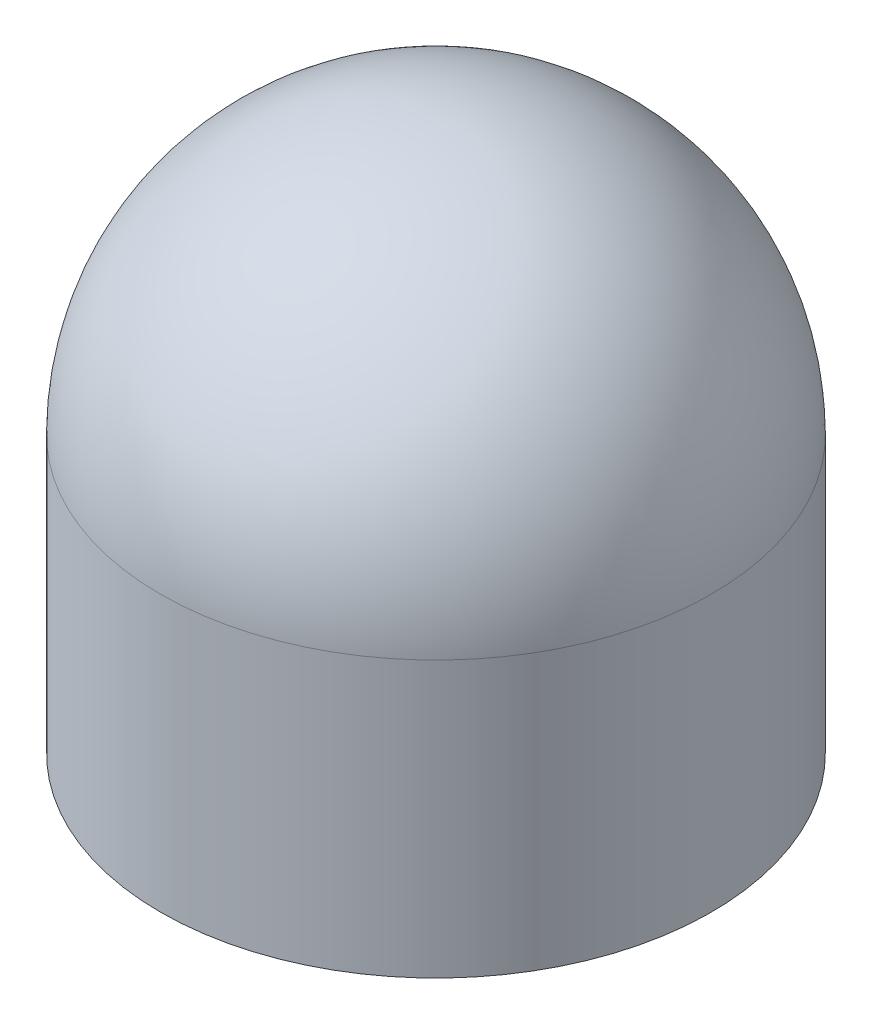
ISO-10303-21;
HEADER;
FILE_DESCRIPTION(('STEP AP214'),'2;1');
FILE_NAME('part.step','',(''),(''),'','','');
FILE_SCHEMA(('AUTOMOTIVE_DESIGN { 1 0 10303 214 1 1 1 1 }'));
ENDSEC;
DATA;
#1=APPLICATION_CONTEXT('core data for automotive mechanical design processes');
#2=APPLICATION_PROTOCOL_DEFINITION('international standard','automotive_design',2000,#1);
#3=PRODUCT_CONTEXT('',#1,'mechanical');
#4=PRODUCT('Part','Part','',(#3));
#5=PRODUCT_RELATED_PRODUCT_CATEGORY('part','',(#4));
#6=PRODUCT_DEFINITION_FORMATION('','',#4);
#7=PRODUCT_DEFINITION_CONTEXT('part definition',#1,'design');
#8=PRODUCT_DEFINITION('design','',#6,#7);
#9=PRODUCT_DEFINITION_SHAPE('','',#8);
#10=(LENGTH_UNIT() NAMED_UNIT(*) SI_UNIT(.MILLI.,.METRE.));
#11=(NAMED_UNIT(*) PLANE_ANGLE_UNIT() SI_UNIT($,.RADIAN.));
#12=(NAMED_UNIT(*) SI_UNIT($,.STERADIAN.) SOLID_ANGLE_UNIT());
#13=UNCERTAINTY_MEASURE_WITH_UNIT(LENGTH_MEASURE(1.E-05),#10,'distance_accuracy_value','');
#14=(GEOMETRIC_REPRESENTATION_CONTEXT(3) GLOBAL_UNCERTAINTY_ASSIGNED_CONTEXT((#13)) GLOBAL_UNIT_ASSIGNED_CONTEXT((#10,
#11,#12)) REPRESENTATION_CONTEXT('',''));
#15=CARTESIAN_POINT('',(0.,0.,0.));
#16=DIRECTION('',(0.,0.,1.));
#17=DIRECTION('',(1.,0.,0.));
#18=AXIS2_PLACEMENT_3D('',#15,#16,#17);
#19=CARTESIAN_POINT('',(-37.1905059288554,3.,-7.69867160947643));
#20=DIRECTION('',(0.,-1.,0.));
#21=DIRECTION('',(0.,0.,-1.));
#22=AXIS2_PLACEMENT_3D('',#19,#20,#21);
#23=CYLINDRICAL_SURFACE('',#22,3.);
#24=CARTESIAN_POINT('',(-37.1905059288554,3.,-7.69867160947643));
#25=DIRECTION('',(0.,1.,0.));
#26=DIRECTION('',(0.,0.,1.));
#27=AXIS2_PLACEMENT_3D('',#24,#25,#26);
#28=CIRCLE('',#27,3.);
#29=CARTESIAN_POINT('',(-37.1905059288554,3.,-4.69867160947643));
#30=VERTEX_POINT('',#29);
#31=EDGE_CURVE('E11',#30,#30,#28,.T.);
#32=ORIENTED_EDGE('',*,*,#31,.F.);
#33=EDGE_LOOP('',(#32));
#34=FACE_BOUND('',#33,.T.);
#35=CARTESIAN_POINT('',(-37.1905059288554,0.,-7.69867160947643));
#36=DIRECTION('',(0.,1.,0.));
#37=DIRECTION('',(0.,0.,1.));
#38=AXIS2_PLACEMENT_3D('',#35,#36,#37);
#39=CIRCLE('',#38,3.);
#40=CARTESIAN_POINT('',(-37.1905059288554,0.,-4.69867160947643));
#41=VERTEX_POINT('',#40);
#42=EDGE_CURVE('E38',#41,#41,#39,.T.);
#43=ORIENTED_EDGE('',*,*,#42,.T.);
#44=EDGE_LOOP('',(#43));
#45=FACE_BOUND('',#44,.T.);
#46=ADVANCED_FACE('F35',(#34,#45),#23,.T.);
#47=CARTESIAN_POINT('',(-37.1905059288554,0.,-7.69867160947643));
#48=DIRECTION('',(0.,1.,0.));
#49=DIRECTION('',(0.,0.,1.));
#50=AXIS2_PLACEMENT_3D('',#47,#48,#49);
#51=PLANE('',#50);
#52=CARTESIAN_POINT('',(-37.1905059288554,0.,-7.69867160947643));
#53=VERTEX_POINT('',#52);
#54=VERTEX_LOOP('',#53);
#55=FACE_BOUND('',#54,.T.);
#56=ORIENTED_EDGE('',*,*,#42,.F.);
#57=EDGE_LOOP('',(#56));
#58=FACE_BOUND('',#57,.T.);
#59=ADVANCED_FACE('F44',(#55,#58),#51,.F.);
#60=CARTESIAN_POINT('',(-37.1905059288554,3.,-7.69867160947643));
#61=DIRECTION('',(0.,0.,-1.));
#62=DIRECTION('',(1.,0.,0.));
#63=AXIS2_PLACEMENT_3D('',#60,#61,#62);
#64=SPHERICAL_SURFACE('',#63,3.);
#65=CARTESIAN_POINT('',(-37.1905059288554,3.,-7.69867160947643));
#66=DIRECTION('',(0.,1.,0.));
#67=DIRECTION('',(0.,0.,1.));
#68=AXIS2_PLACEMENT_3D('',#65,#66,#67);
#69=SPHERICAL_SURFACE('',#68,3.);
#70=ORIENTED_EDGE('',*,*,#31,.T.);
#71=EDGE_LOOP('',(#70));
#72=FACE_BOUND('',#71,.T.);
#73=ADVANCED_FACE('F47',(#72),#69,.T.);
#74=CLOSED_SHELL('',(#46,#59,#73));
#75=MANIFOLD_SOLID_BREP('B2',#74);
#76=ADVANCED_BREP_SHAPE_REPRESENTATION('',(#18,#75),#14);
#77=SHAPE_DEFINITION_REPRESENTATION(#9,#76);
ENDSEC;
END-ISO-10303-21;
